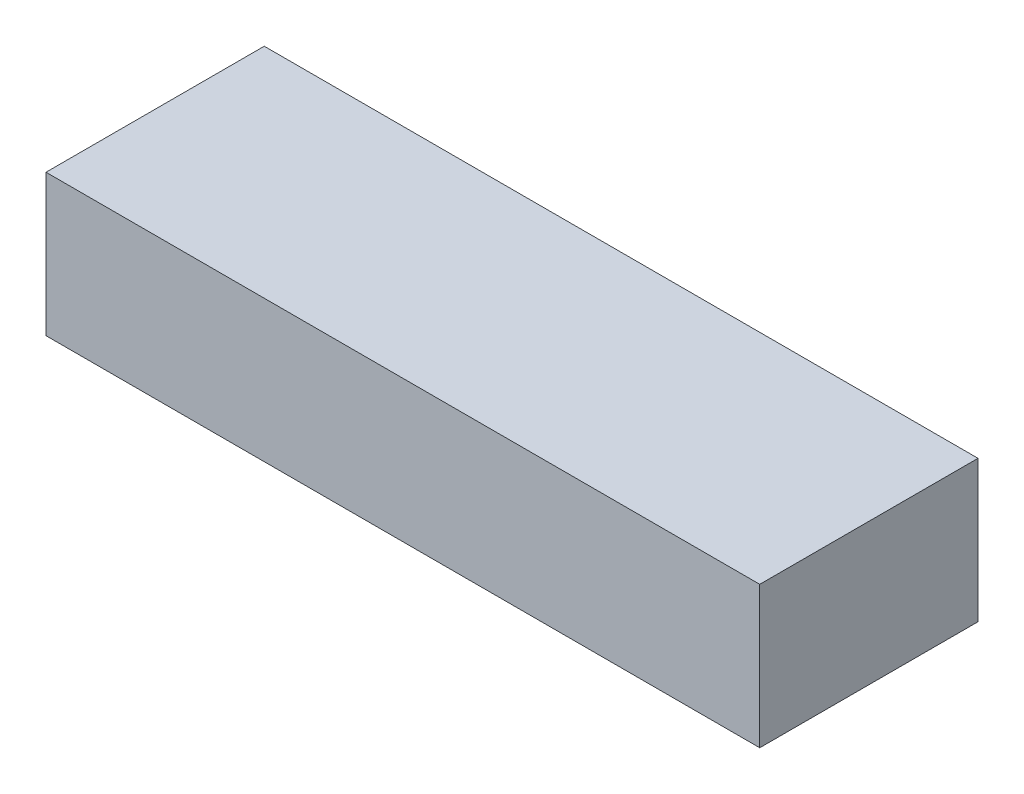
ISO-10303-21;
HEADER;
FILE_DESCRIPTION(('STEP AP214'),'2;1');
FILE_NAME('part.step','',(''),(''),'','','');
FILE_SCHEMA(('AUTOMOTIVE_DESIGN { 1 0 10303 214 1 1 1 1 }'));
ENDSEC;
DATA;
#1=APPLICATION_CONTEXT('core data for automotive mechanical design processes');
#2=APPLICATION_PROTOCOL_DEFINITION('international standard','automotive_design',2000,#1);
#3=PRODUCT_CONTEXT('',#1,'mechanical');
#4=PRODUCT('Part','Part','',(#3));
#5=PRODUCT_RELATED_PRODUCT_CATEGORY('part','',(#4));
#6=PRODUCT_DEFINITION_FORMATION('','',#4);
#7=PRODUCT_DEFINITION_CONTEXT('part definition',#1,'design');
#8=PRODUCT_DEFINITION('design','',#6,#7);
#9=PRODUCT_DEFINITION_SHAPE('','',#8);
#10=(LENGTH_UNIT() NAMED_UNIT(*) SI_UNIT(.MILLI.,.METRE.));
#11=(NAMED_UNIT(*) PLANE_ANGLE_UNIT() SI_UNIT($,.RADIAN.));
#12=(NAMED_UNIT(*) SI_UNIT($,.STERADIAN.) SOLID_ANGLE_UNIT());
#13=UNCERTAINTY_MEASURE_WITH_UNIT(LENGTH_MEASURE(1.E-05),#10,'distance_accuracy_value','');
#14=(GEOMETRIC_REPRESENTATION_CONTEXT(3) GLOBAL_UNCERTAINTY_ASSIGNED_CONTEXT((#13)) GLOBAL_UNIT_ASSIGNED_CONTEXT((#10,
#11,#12)) REPRESENTATION_CONTEXT('',''));
#15=CARTESIAN_POINT('',(0.,0.,0.));
#16=DIRECTION('',(0.,0.,1.));
#17=DIRECTION('',(1.,0.,0.));
#18=AXIS2_PLACEMENT_3D('',#15,#16,#17);
#19=CARTESIAN_POINT('',(0.,-304.8,0.));
#20=DIRECTION('',(-1.,0.,0.));
#21=DIRECTION('',(0.,0.,1.));
#22=AXIS2_PLACEMENT_3D('',#19,#20,#21);
#23=PLANE('',#22);
#24=DIRECTION('',(0.,0.,1.));
#25=VECTOR('',#24,1.);
#26=CARTESIAN_POINT('',(0.,0.,0.));
#27=LINE('',#26,#25);
#28=CARTESIAN_POINT('',(0.,0.,-469.9));
#29=VERTEX_POINT('',#28);
#30=CARTESIAN_POINT('',(0.,0.,0.));
#31=VERTEX_POINT('',#30);
#32=EDGE_CURVE('E112',#29,#31,#27,.T.);
#33=ORIENTED_EDGE('',*,*,#32,.F.);
#34=DIRECTION('',(0.,1.,0.));
#35=VECTOR('',#34,1.);
#36=CARTESIAN_POINT('',(0.,-304.8,-469.9));
#37=LINE('',#36,#35);
#38=CARTESIAN_POINT('',(0.,-304.8,-469.9));
#39=VERTEX_POINT('',#38);
#40=EDGE_CURVE('E11',#39,#29,#37,.T.);
#41=ORIENTED_EDGE('',*,*,#40,.F.);
#42=DIRECTION('',(0.,0.,1.));
#43=VECTOR('',#42,1.);
#44=CARTESIAN_POINT('',(0.,-304.8,0.));
#45=LINE('',#44,#43);
#46=CARTESIAN_POINT('',(0.,-304.8,0.));
#47=VERTEX_POINT('',#46);
#48=EDGE_CURVE('E104',#39,#47,#45,.T.);
#49=ORIENTED_EDGE('',*,*,#48,.T.);
#50=DIRECTION('',(0.,1.,0.));
#51=VECTOR('',#50,1.);
#52=CARTESIAN_POINT('',(0.,-304.8,0.));
#53=LINE('',#52,#51);
#54=EDGE_CURVE('E45',#47,#31,#53,.T.);
#55=ORIENTED_EDGE('',*,*,#54,.T.);
#56=EDGE_LOOP('',(#33,#41,#49,#55));
#57=FACE_BOUND('',#56,.T.);
#58=ADVANCED_FACE('F42',(#57),#23,.T.);
#59=CARTESIAN_POINT('',(0.,-304.8,-469.9));
#60=DIRECTION('',(0.,0.,-1.));
#61=DIRECTION('',(-1.,0.,0.));
#62=AXIS2_PLACEMENT_3D('',#59,#60,#61);
#63=PLANE('',#62);
#64=DIRECTION('',(-1.,0.,0.));
#65=VECTOR('',#64,1.);
#66=CARTESIAN_POINT('',(0.,0.,-469.9));
#67=LINE('',#66,#65);
#68=CARTESIAN_POINT('',(1536.7,0.,-469.9));
#69=VERTEX_POINT('',#68);
#70=EDGE_CURVE('E107',#69,#29,#67,.T.);
#71=ORIENTED_EDGE('',*,*,#70,.F.);
#72=DIRECTION('',(0.,1.,0.));
#73=VECTOR('',#72,1.);
#74=CARTESIAN_POINT('',(1536.7,-304.8,-469.9));
#75=LINE('',#74,#73);
#76=CARTESIAN_POINT('',(1536.7,-304.8,-469.9));
#77=VERTEX_POINT('',#76);
#78=EDGE_CURVE('E52',#77,#69,#75,.T.);
#79=ORIENTED_EDGE('',*,*,#78,.F.);
#80=DIRECTION('',(-1.,0.,0.));
#81=VECTOR('',#80,1.);
#82=CARTESIAN_POINT('',(0.,-304.8,-469.9));
#83=LINE('',#82,#81);
#84=EDGE_CURVE('E99',#77,#39,#83,.T.);
#85=ORIENTED_EDGE('',*,*,#84,.T.);
#86=ORIENTED_EDGE('',*,*,#40,.T.);
#87=EDGE_LOOP('',(#71,#79,#85,#86));
#88=FACE_BOUND('',#87,.T.);
#89=ADVANCED_FACE('F128',(#88),#63,.T.);
#90=CARTESIAN_POINT('',(1536.7,-304.8,0.));
#91=DIRECTION('',(1.,0.,0.));
#92=DIRECTION('',(0.,0.,-1.));
#93=AXIS2_PLACEMENT_3D('',#90,#91,#92);
#94=PLANE('',#93);
#95=DIRECTION('',(0.,0.,-1.));
#96=VECTOR('',#95,1.);
#97=CARTESIAN_POINT('',(1536.7,0.,0.));
#98=LINE('',#97,#96);
#99=CARTESIAN_POINT('',(1536.7,0.,0.));
#100=VERTEX_POINT('',#99);
#101=EDGE_CURVE('E93',#100,#69,#98,.T.);
#102=ORIENTED_EDGE('',*,*,#101,.F.);
#103=DIRECTION('',(0.,1.,0.));
#104=VECTOR('',#103,1.);
#105=CARTESIAN_POINT('',(1536.7,-304.8,0.));
#106=LINE('',#105,#104);
#107=CARTESIAN_POINT('',(1536.7,-304.8,0.));
#108=VERTEX_POINT('',#107);
#109=EDGE_CURVE('E88',#108,#100,#106,.T.);
#110=ORIENTED_EDGE('',*,*,#109,.F.);
#111=DIRECTION('',(0.,0.,-1.));
#112=VECTOR('',#111,1.);
#113=CARTESIAN_POINT('',(1536.7,-304.8,0.));
#114=LINE('',#113,#112);
#115=EDGE_CURVE('E91',#108,#77,#114,.T.);
#116=ORIENTED_EDGE('',*,*,#115,.T.);
#117=ORIENTED_EDGE('',*,*,#78,.T.);
#118=EDGE_LOOP('',(#102,#110,#116,#117));
#119=FACE_BOUND('',#118,.T.);
#120=ADVANCED_FACE('F90',(#119),#94,.T.);
#121=CARTESIAN_POINT('',(0.,-304.8,0.));
#122=DIRECTION('',(0.,0.,1.));
#123=DIRECTION('',(1.,0.,0.));
#124=AXIS2_PLACEMENT_3D('',#121,#122,#123);
#125=PLANE('',#124);
#126=DIRECTION('',(1.,0.,0.));
#127=VECTOR('',#126,1.);
#128=CARTESIAN_POINT('',(0.,0.,0.));
#129=LINE('',#128,#127);
#130=EDGE_CURVE('E116',#31,#100,#129,.T.);
#131=ORIENTED_EDGE('',*,*,#130,.F.);
#132=ORIENTED_EDGE('',*,*,#54,.F.);
#133=DIRECTION('',(1.,0.,0.));
#134=VECTOR('',#133,1.);
#135=CARTESIAN_POINT('',(0.,-304.8,0.));
#136=LINE('',#135,#134);
#137=EDGE_CURVE('E98',#47,#108,#136,.T.);
#138=ORIENTED_EDGE('',*,*,#137,.T.);
#139=ORIENTED_EDGE('',*,*,#109,.T.);
#140=EDGE_LOOP('',(#131,#132,#138,#139));
#141=FACE_BOUND('',#140,.T.);
#142=ADVANCED_FACE('F102',(#141),#125,.T.);
#143=CARTESIAN_POINT('',(0.,-304.8,0.));
#144=DIRECTION('',(0.,-1.,0.));
#145=DIRECTION('',(0.,0.,-1.));
#146=AXIS2_PLACEMENT_3D('',#143,#144,#145);
#147=PLANE('',#146);
#148=ORIENTED_EDGE('',*,*,#48,.F.);
#149=ORIENTED_EDGE('',*,*,#84,.F.);
#150=ORIENTED_EDGE('',*,*,#115,.F.);
#151=ORIENTED_EDGE('',*,*,#137,.F.);
#152=EDGE_LOOP('',(#148,#149,#150,#151));
#153=FACE_BOUND('',#152,.T.);
#154=ADVANCED_FACE('F97',(#153),#147,.T.);
#155=CARTESIAN_POINT('',(0.,0.,0.));
#156=DIRECTION('',(0.,-1.,0.));
#157=DIRECTION('',(0.,0.,-1.));
#158=AXIS2_PLACEMENT_3D('',#155,#156,#157);
#159=PLANE('',#158);
#160=ORIENTED_EDGE('',*,*,#32,.T.);
#161=ORIENTED_EDGE('',*,*,#130,.T.);
#162=ORIENTED_EDGE('',*,*,#101,.T.);
#163=ORIENTED_EDGE('',*,*,#70,.T.);
#164=EDGE_LOOP('',(#160,#161,#162,#163));
#165=FACE_BOUND('',#164,.T.);
#166=ADVANCED_FACE('F127',(#165),#159,.F.);
#167=CLOSED_SHELL('',(#58,#89,#120,#142,#154,#166));
#168=MANIFOLD_SOLID_BREP('B2',#167);
#169=ADVANCED_BREP_SHAPE_REPRESENTATION('',(#18,#168),#14);
#170=SHAPE_DEFINITION_REPRESENTATION(#9,#169);
ENDSEC;
END-ISO-10303-21;
